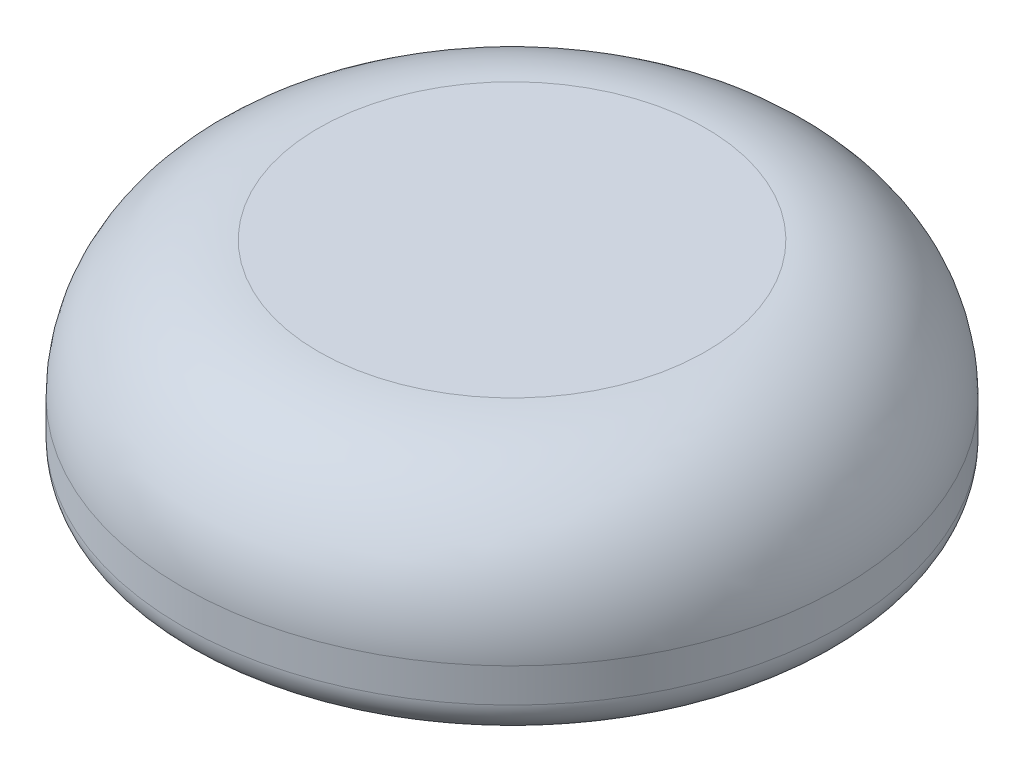
ISO-10303-21;
HEADER;
FILE_DESCRIPTION(('STEP AP214'),'2;1');
FILE_NAME('part.step','',(''),(''),'','','');
FILE_SCHEMA(('AUTOMOTIVE_DESIGN { 1 0 10303 214 1 1 1 1 }'));
ENDSEC;
DATA;
#1=APPLICATION_CONTEXT('core data for automotive mechanical design processes');
#2=APPLICATION_PROTOCOL_DEFINITION('international standard','automotive_design',2000,#1);
#3=PRODUCT_CONTEXT('',#1,'mechanical');
#4=PRODUCT('Part','Part','',(#3));
#5=PRODUCT_RELATED_PRODUCT_CATEGORY('part','',(#4));
#6=PRODUCT_DEFINITION_FORMATION('','',#4);
#7=PRODUCT_DEFINITION_CONTEXT('part definition',#1,'design');
#8=PRODUCT_DEFINITION('design','',#6,#7);
#9=PRODUCT_DEFINITION_SHAPE('','',#8);
#10=(LENGTH_UNIT() NAMED_UNIT(*) SI_UNIT(.MILLI.,.METRE.));
#11=(NAMED_UNIT(*) PLANE_ANGLE_UNIT() SI_UNIT($,.RADIAN.));
#12=(NAMED_UNIT(*) SI_UNIT($,.STERADIAN.) SOLID_ANGLE_UNIT());
#13=UNCERTAINTY_MEASURE_WITH_UNIT(LENGTH_MEASURE(1.E-05),#10,'distance_accuracy_value','');
#14=(GEOMETRIC_REPRESENTATION_CONTEXT(3) GLOBAL_UNCERTAINTY_ASSIGNED_CONTEXT((#13)) GLOBAL_UNIT_ASSIGNED_CONTEXT((#10,
#11,#12)) REPRESENTATION_CONTEXT('',''));
#15=CARTESIAN_POINT('',(0.,0.,0.));
#16=DIRECTION('',(0.,0.,1.));
#17=DIRECTION('',(1.,0.,0.));
#18=AXIS2_PLACEMENT_3D('',#15,#16,#17);
#19=CARTESIAN_POINT('',(0.,-2.60858000000024,0.));
#20=DIRECTION('',(0.,1.,0.));
#21=DIRECTION('',(0.,0.,1.));
#22=AXIS2_PLACEMENT_3D('',#19,#20,#21);
#23=PLANE('',#22);
#24=CARTESIAN_POINT('',(0.,-2.60858000000024,0.));
#25=DIRECTION('',(0.,1.,0.));
#26=DIRECTION('',(0.,0.,1.));
#27=AXIS2_PLACEMENT_3D('',#24,#25,#26);
#28=CIRCLE('',#27,8.53450468805878);
#29=CARTESIAN_POINT('',(0.,-2.60858000000024,8.53450468805884));
#30=VERTEX_POINT('',#29);
#31=EDGE_CURVE('E10',#30,#30,#28,.T.);
#32=ORIENTED_EDGE('',*,*,#31,.F.);
#33=EDGE_LOOP('',(#32));
#34=FACE_BOUND('',#33,.T.);
#35=ADVANCED_FACE('F34',(#34),#23,.F.);
#36=CARTESIAN_POINT('',(0.,-3.88240079271404,0.));
#37=DIRECTION('',(0.,1.,0.));
#38=DIRECTION('',(0.,0.,1.));
#39=AXIS2_PLACEMENT_3D('',#36,#37,#38);
#40=TOROIDAL_SURFACE('',#39,8.53450468805878,1.27382079271378);
#41=CARTESIAN_POINT('',(0.,-4.68336138049465,0.));
#42=DIRECTION('',(0.,1.,0.));
#43=DIRECTION('',(0.,0.,1.));
#44=AXIS2_PLACEMENT_3D('',#41,#42,#43);
#45=CIRCLE('',#44,9.52500029570785);
#46=CARTESIAN_POINT('',(0.,-4.68336138049465,9.52500029570791));
#47=VERTEX_POINT('',#46);
#48=EDGE_CURVE('E40',#47,#47,#45,.T.);
#49=ORIENTED_EDGE('',*,*,#48,.F.);
#50=EDGE_LOOP('',(#49));
#51=FACE_BOUND('',#50,.T.);
#52=ORIENTED_EDGE('',*,*,#31,.T.);
#53=EDGE_LOOP('',(#52));
#54=FACE_BOUND('',#53,.T.);
#55=ADVANCED_FACE('F100',(#51,#54),#40,.F.);
#56=CARTESIAN_POINT('',(0.,-2.60858000000024,0.));
#57=DIRECTION('',(0.,1.,0.));
#58=DIRECTION('',(0.,0.,1.));
#59=AXIS2_PLACEMENT_3D('',#56,#57,#58);
#60=CYLINDRICAL_SURFACE('',#59,9.52500029570787);
#61=CARTESIAN_POINT('',(0.,-6.34975093157288,0.));
#62=DIRECTION('',(0.,1.,0.));
#63=DIRECTION('',(0.,0.,1.));
#64=AXIS2_PLACEMENT_3D('',#61,#62,#63);
#65=CIRCLE('',#64,9.52500029570789);
#66=CARTESIAN_POINT('',(0.,-6.34975093157288,9.52500029570795));
#67=VERTEX_POINT('',#66);
#68=EDGE_CURVE('E44',#67,#67,#65,.T.);
#69=ORIENTED_EDGE('',*,*,#68,.F.);
#70=EDGE_LOOP('',(#69));
#71=FACE_BOUND('',#70,.T.);
#72=ORIENTED_EDGE('',*,*,#48,.T.);
#73=EDGE_LOOP('',(#72));
#74=FACE_BOUND('',#73,.T.);
#75=ADVANCED_FACE('F95',(#71,#74),#60,.F.);
#76=CARTESIAN_POINT('',(0.,-6.34975093157288,0.));
#77=DIRECTION('',(0.,1.,0.));
#78=DIRECTION('',(0.,0.,1.));
#79=AXIS2_PLACEMENT_3D('',#76,#77,#78);
#80=TOROIDAL_SURFACE('',#79,10.795249364135,1.27024906842712);
#81=CARTESIAN_POINT('',(0.,-7.62,0.));
#82=DIRECTION('',(0.,1.,0.));
#83=DIRECTION('',(0.,0.,1.));
#84=AXIS2_PLACEMENT_3D('',#81,#82,#83);
#85=CIRCLE('',#84,10.795249364135);
#86=CARTESIAN_POINT('',(0.,-7.62,10.7952493641351));
#87=VERTEX_POINT('',#86);
#88=EDGE_CURVE('E48',#87,#87,#85,.T.);
#89=ORIENTED_EDGE('',*,*,#88,.F.);
#90=EDGE_LOOP('',(#89));
#91=FACE_BOUND('',#90,.T.);
#92=ORIENTED_EDGE('',*,*,#68,.T.);
#93=EDGE_LOOP('',(#92));
#94=FACE_BOUND('',#93,.T.);
#95=ADVANCED_FACE('F89',(#91,#94),#80,.T.);
#96=CARTESIAN_POINT('',(0.,-7.62,-10.795249364135));
#97=DIRECTION('',(0.,1.,0.));
#98=DIRECTION('',(0.,0.,1.));
#99=AXIS2_PLACEMENT_3D('',#96,#97,#98);
#100=PLANE('',#99);
#101=CARTESIAN_POINT('',(0.,-7.62,0.));
#102=DIRECTION('',(0.,1.,0.));
#103=DIRECTION('',(0.,0.,1.));
#104=AXIS2_PLACEMENT_3D('',#101,#102,#103);
#105=CIRCLE('',#104,11.0487512274687);
#106=CARTESIAN_POINT('',(0.,-7.62,11.0487512274687));
#107=VERTEX_POINT('',#106);
#108=EDGE_CURVE('E53',#107,#107,#105,.T.);
#109=ORIENTED_EDGE('',*,*,#108,.F.);
#110=EDGE_LOOP('',(#109));
#111=FACE_BOUND('',#110,.T.);
#112=ORIENTED_EDGE('',*,*,#88,.T.);
#113=EDGE_LOOP('',(#112));
#114=FACE_BOUND('',#113,.T.);
#115=ADVANCED_FACE('F83',(#111,#114),#100,.F.);
#116=CARTESIAN_POINT('',(0.,-6.34975093158227,0.));
#117=DIRECTION('',(0.,1.,0.));
#118=DIRECTION('',(0.,0.,1.));
#119=AXIS2_PLACEMENT_3D('',#116,#117,#118);
#120=TOROIDAL_SURFACE('',#119,11.0487512274687,1.27024906841773);
#121=CARTESIAN_POINT('',(0.,-6.34975093158227,0.));
#122=DIRECTION('',(0.,1.,0.));
#123=DIRECTION('',(0.,0.,1.));
#124=AXIS2_PLACEMENT_3D('',#121,#122,#123);
#125=CIRCLE('',#124,12.3190002958864);
#126=CARTESIAN_POINT('',(0.,-6.34975093158227,12.3190002958865));
#127=VERTEX_POINT('',#126);
#128=EDGE_CURVE('E56',#127,#127,#125,.T.);
#129=ORIENTED_EDGE('',*,*,#128,.F.);
#130=EDGE_LOOP('',(#129));
#131=FACE_BOUND('',#130,.T.);
#132=ORIENTED_EDGE('',*,*,#108,.T.);
#133=EDGE_LOOP('',(#132));
#134=FACE_BOUND('',#133,.T.);
#135=ADVANCED_FACE('F77',(#131,#134),#120,.T.);
#136=CARTESIAN_POINT('',(0.,-2.60858000000024,0.));
#137=DIRECTION('',(0.,1.,0.));
#138=DIRECTION('',(0.,0.,1.));
#139=AXIS2_PLACEMENT_3D('',#136,#137,#138);
#140=CYLINDRICAL_SURFACE('',#139,12.3190002958864);
#141=CARTESIAN_POINT('',(0.,-5.08099624935208,0.));
#142=DIRECTION('',(0.,1.,0.));
#143=DIRECTION('',(0.,0.,1.));
#144=AXIS2_PLACEMENT_3D('',#141,#142,#143);
#145=CIRCLE('',#144,12.3190002958864);
#146=CARTESIAN_POINT('',(0.,-5.08099624935208,12.3190002958865));
#147=VERTEX_POINT('',#146);
#148=EDGE_CURVE('E59',#147,#147,#145,.T.);
#149=ORIENTED_EDGE('',*,*,#148,.F.);
#150=EDGE_LOOP('',(#149));
#151=FACE_BOUND('',#150,.T.);
#152=ORIENTED_EDGE('',*,*,#128,.T.);
#153=EDGE_LOOP('',(#152));
#154=FACE_BOUND('',#153,.T.);
#155=ADVANCED_FACE('F71',(#151,#154),#140,.T.);
#156=CARTESIAN_POINT('',(0.,-5.08099624935209,0.));
#157=DIRECTION('',(0.,1.,0.));
#158=DIRECTION('',(0.,0.,1.));
#159=AXIS2_PLACEMENT_3D('',#156,#157,#158);
#160=TOROIDAL_SURFACE('',#159,7.23800404653432,5.08099624935209);
#161=CARTESIAN_POINT('',(0.,0.,0.));
#162=DIRECTION('',(0.,1.,0.));
#163=DIRECTION('',(0.,0.,1.));
#164=AXIS2_PLACEMENT_3D('',#161,#162,#163);
#165=CIRCLE('',#164,7.23800404653432);
#166=CARTESIAN_POINT('',(0.,0.,7.23800404653438));
#167=VERTEX_POINT('',#166);
#168=EDGE_CURVE('E62',#167,#167,#165,.T.);
#169=ORIENTED_EDGE('',*,*,#168,.F.);
#170=EDGE_LOOP('',(#169));
#171=FACE_BOUND('',#170,.T.);
#172=ORIENTED_EDGE('',*,*,#148,.T.);
#173=EDGE_LOOP('',(#172));
#174=FACE_BOUND('',#173,.T.);
#175=ADVANCED_FACE('F68',(#171,#174),#160,.T.);
#176=CARTESIAN_POINT('',(0.,0.,0.));
#177=DIRECTION('',(0.,-1.,0.));
#178=DIRECTION('',(0.,0.,-1.));
#179=AXIS2_PLACEMENT_3D('',#176,#177,#178);
#180=PLANE('',#179);
#181=ORIENTED_EDGE('',*,*,#168,.T.);
#182=EDGE_LOOP('',(#181));
#183=FACE_BOUND('',#182,.T.);
#184=ADVANCED_FACE('F66',(#183),#180,.F.);
#185=CLOSED_SHELL('',(#35,#55,#75,#95,#115,#135,#155,#175,#184));
#186=MANIFOLD_SOLID_BREP('B2',#185);
#187=ADVANCED_BREP_SHAPE_REPRESENTATION('',(#18,#186),#14);
#188=SHAPE_DEFINITION_REPRESENTATION(#9,#187);
ENDSEC;
END-ISO-10303-21;
